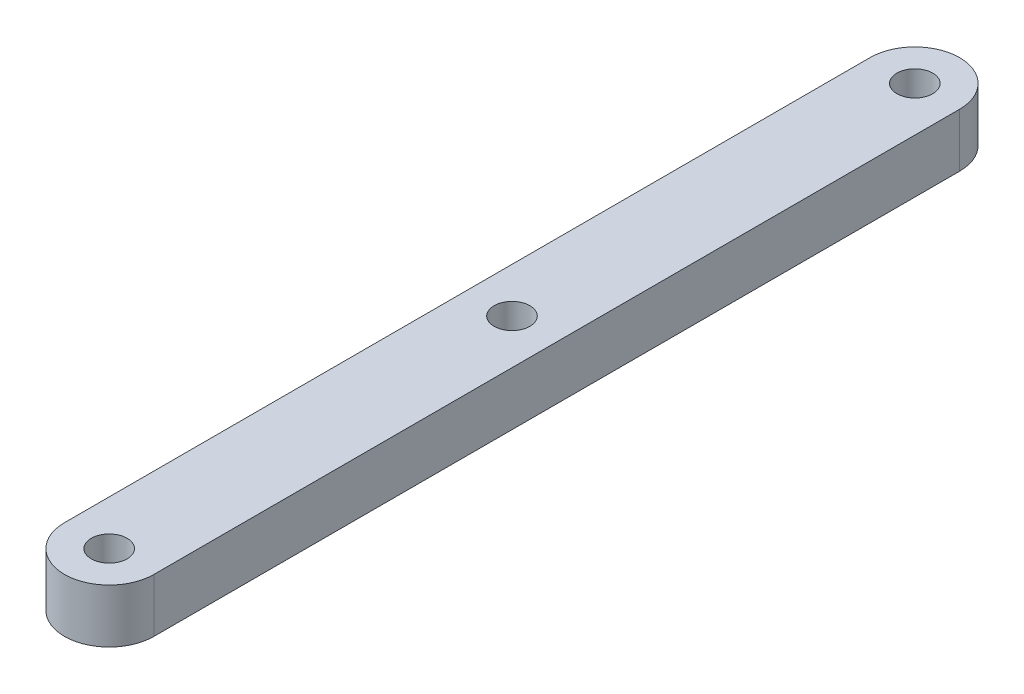
ISO-10303-21;
HEADER;
FILE_DESCRIPTION(('STEP AP214'),'2;1');
FILE_NAME('part.step','',(''),(''),'','','');
FILE_SCHEMA(('AUTOMOTIVE_DESIGN { 1 0 10303 214 1 1 1 1 }'));
ENDSEC;
DATA;
#1=APPLICATION_CONTEXT('core data for automotive mechanical design processes');
#2=APPLICATION_PROTOCOL_DEFINITION('international standard','automotive_design',2000,#1);
#3=PRODUCT_CONTEXT('',#1,'mechanical');
#4=PRODUCT('Part','Part','',(#3));
#5=PRODUCT_RELATED_PRODUCT_CATEGORY('part','',(#4));
#6=PRODUCT_DEFINITION_FORMATION('','',#4);
#7=PRODUCT_DEFINITION_CONTEXT('part definition',#1,'design');
#8=PRODUCT_DEFINITION('design','',#6,#7);
#9=PRODUCT_DEFINITION_SHAPE('','',#8);
#10=(LENGTH_UNIT() NAMED_UNIT(*) SI_UNIT(.MILLI.,.METRE.));
#11=(NAMED_UNIT(*) PLANE_ANGLE_UNIT() SI_UNIT($,.RADIAN.));
#12=(NAMED_UNIT(*) SI_UNIT($,.STERADIAN.) SOLID_ANGLE_UNIT());
#13=UNCERTAINTY_MEASURE_WITH_UNIT(LENGTH_MEASURE(1.E-05),#10,'distance_accuracy_value','');
#14=(GEOMETRIC_REPRESENTATION_CONTEXT(3) GLOBAL_UNCERTAINTY_ASSIGNED_CONTEXT((#13)) GLOBAL_UNIT_ASSIGNED_CONTEXT((#10,
#11,#12)) REPRESENTATION_CONTEXT('',''));
#15=CARTESIAN_POINT('',(0.,0.,0.));
#16=DIRECTION('',(0.,0.,1.));
#17=DIRECTION('',(1.,0.,0.));
#18=AXIS2_PLACEMENT_3D('',#15,#16,#17);
#19=CARTESIAN_POINT('',(0.,3.,-22.5));
#20=DIRECTION('',(0.,1.,0.));
#21=DIRECTION('',(0.,0.,1.));
#22=AXIS2_PLACEMENT_3D('',#19,#20,#21);
#23=PLANE('',#22);
#24=CARTESIAN_POINT('',(0.,3.,-22.5));
#25=DIRECTION('',(0.,1.,0.));
#26=DIRECTION('',(0.,0.,1.));
#27=AXIS2_PLACEMENT_3D('',#24,#25,#26);
#28=CIRCLE('',#27,1.);
#29=CARTESIAN_POINT('',(0.,3.,-21.5));
#30=VERTEX_POINT('',#29);
#31=EDGE_CURVE('E115',#30,#30,#28,.T.);
#32=ORIENTED_EDGE('',*,*,#31,.F.);
#33=EDGE_LOOP('',(#32));
#34=FACE_BOUND('',#33,.T.);
#35=CARTESIAN_POINT('',(0.,3.,-22.5));
#36=DIRECTION('',(0.,1.,0.));
#37=DIRECTION('',(0.,0.,1.));
#38=AXIS2_PLACEMENT_3D('',#35,#36,#37);
#39=CIRCLE('',#38,2.5);
#40=CARTESIAN_POINT('',(2.49999999999999,3.,-22.5));
#41=VERTEX_POINT('',#40);
#42=CARTESIAN_POINT('',(-2.50000000000001,3.,-22.5));
#43=VERTEX_POINT('',#42);
#44=EDGE_CURVE('E85',#41,#43,#39,.T.);
#45=ORIENTED_EDGE('',*,*,#44,.T.);
#46=DIRECTION('',(0.,0.,1.));
#47=VECTOR('',#46,1.);
#48=CARTESIAN_POINT('',(-2.50000000000001,3.,-22.5));
#49=LINE('',#48,#47);
#50=CARTESIAN_POINT('',(-2.49999999999999,3.,22.5));
#51=VERTEX_POINT('',#50);
#52=EDGE_CURVE('E80',#43,#51,#49,.T.);
#53=ORIENTED_EDGE('',*,*,#52,.T.);
#54=CARTESIAN_POINT('',(0.,3.,22.5));
#55=DIRECTION('',(0.,1.,0.));
#56=DIRECTION('',(0.,0.,1.));
#57=AXIS2_PLACEMENT_3D('',#54,#55,#56);
#58=CIRCLE('',#57,2.5);
#59=CARTESIAN_POINT('',(2.5,3.,22.5));
#60=VERTEX_POINT('',#59);
#61=EDGE_CURVE('E83',#51,#60,#58,.T.);
#62=ORIENTED_EDGE('',*,*,#61,.T.);
#63=DIRECTION('',(0.,0.,-1.));
#64=VECTOR('',#63,1.);
#65=CARTESIAN_POINT('',(2.49999999999999,3.,-22.5));
#66=LINE('',#65,#64);
#67=EDGE_CURVE('E50',#60,#41,#66,.T.);
#68=ORIENTED_EDGE('',*,*,#67,.T.);
#69=EDGE_LOOP('',(#45,#53,#62,#68));
#70=FACE_BOUND('',#69,.T.);
#71=CARTESIAN_POINT('',(0.,3.,22.5));
#72=DIRECTION('',(0.,1.,0.));
#73=DIRECTION('',(0.,0.,1.));
#74=AXIS2_PLACEMENT_3D('',#71,#72,#73);
#75=CIRCLE('',#74,1.);
#76=CARTESIAN_POINT('',(0.,3.,23.5));
#77=VERTEX_POINT('',#76);
#78=EDGE_CURVE('E100',#77,#77,#75,.T.);
#79=ORIENTED_EDGE('',*,*,#78,.F.);
#80=EDGE_LOOP('',(#79));
#81=FACE_BOUND('',#80,.T.);
#82=CARTESIAN_POINT('',(0.,3.,0.));
#83=DIRECTION('',(0.,1.,0.));
#84=DIRECTION('',(0.,0.,1.));
#85=AXIS2_PLACEMENT_3D('',#82,#83,#84);
#86=CIRCLE('',#85,1.);
#87=CARTESIAN_POINT('',(0.,3.,1.));
#88=VERTEX_POINT('',#87);
#89=EDGE_CURVE('E121',#88,#88,#86,.T.);
#90=ORIENTED_EDGE('',*,*,#89,.F.);
#91=EDGE_LOOP('',(#90));
#92=FACE_BOUND('',#91,.T.);
#93=ADVANCED_FACE('F33',(#34,#70,#81,#92),#23,.T.);
#94=CARTESIAN_POINT('',(0.,0.,-22.5));
#95=DIRECTION('',(0.,1.,0.));
#96=DIRECTION('',(0.,0.,1.));
#97=AXIS2_PLACEMENT_3D('',#94,#95,#96);
#98=PLANE('',#97);
#99=CARTESIAN_POINT('',(0.,0.,-22.5));
#100=DIRECTION('',(0.,1.,0.));
#101=DIRECTION('',(0.,0.,1.));
#102=AXIS2_PLACEMENT_3D('',#99,#100,#101);
#103=CIRCLE('',#102,2.5);
#104=CARTESIAN_POINT('',(2.49999999999999,0.,-22.5));
#105=VERTEX_POINT('',#104);
#106=CARTESIAN_POINT('',(-2.50000000000001,0.,-22.5));
#107=VERTEX_POINT('',#106);
#108=EDGE_CURVE('E97',#105,#107,#103,.T.);
#109=ORIENTED_EDGE('',*,*,#108,.F.);
#110=DIRECTION('',(0.,0.,-1.));
#111=VECTOR('',#110,1.);
#112=CARTESIAN_POINT('',(2.49999999999999,0.,-22.5));
#113=LINE('',#112,#111);
#114=CARTESIAN_POINT('',(2.5,0.,22.5));
#115=VERTEX_POINT('',#114);
#116=EDGE_CURVE('E73',#115,#105,#113,.T.);
#117=ORIENTED_EDGE('',*,*,#116,.F.);
#118=CARTESIAN_POINT('',(0.,0.,22.5));
#119=DIRECTION('',(0.,1.,0.));
#120=DIRECTION('',(0.,0.,1.));
#121=AXIS2_PLACEMENT_3D('',#118,#119,#120);
#122=CIRCLE('',#121,2.5);
#123=CARTESIAN_POINT('',(-2.49999999999999,0.,22.5));
#124=VERTEX_POINT('',#123);
#125=EDGE_CURVE('E67',#124,#115,#122,.T.);
#126=ORIENTED_EDGE('',*,*,#125,.F.);
#127=DIRECTION('',(0.,0.,1.));
#128=VECTOR('',#127,1.);
#129=CARTESIAN_POINT('',(-2.50000000000001,0.,-22.5));
#130=LINE('',#129,#128);
#131=EDGE_CURVE('E89',#107,#124,#130,.T.);
#132=ORIENTED_EDGE('',*,*,#131,.F.);
#133=EDGE_LOOP('',(#109,#117,#126,#132));
#134=FACE_BOUND('',#133,.T.);
#135=CARTESIAN_POINT('',(0.,0.,22.5));
#136=DIRECTION('',(0.,1.,0.));
#137=DIRECTION('',(0.,0.,1.));
#138=AXIS2_PLACEMENT_3D('',#135,#136,#137);
#139=CIRCLE('',#138,1.);
#140=CARTESIAN_POINT('',(0.,0.,23.5));
#141=VERTEX_POINT('',#140);
#142=EDGE_CURVE('E112',#141,#141,#139,.T.);
#143=ORIENTED_EDGE('',*,*,#142,.T.);
#144=EDGE_LOOP('',(#143));
#145=FACE_BOUND('',#144,.T.);
#146=CARTESIAN_POINT('',(0.,0.,-22.5));
#147=DIRECTION('',(0.,1.,0.));
#148=DIRECTION('',(0.,0.,1.));
#149=AXIS2_PLACEMENT_3D('',#146,#147,#148);
#150=CIRCLE('',#149,1.);
#151=CARTESIAN_POINT('',(0.,0.,-21.5));
#152=VERTEX_POINT('',#151);
#153=EDGE_CURVE('E118',#152,#152,#150,.T.);
#154=ORIENTED_EDGE('',*,*,#153,.T.);
#155=EDGE_LOOP('',(#154));
#156=FACE_BOUND('',#155,.T.);
#157=CARTESIAN_POINT('',(0.,0.,0.));
#158=DIRECTION('',(0.,1.,0.));
#159=DIRECTION('',(0.,0.,1.));
#160=AXIS2_PLACEMENT_3D('',#157,#158,#159);
#161=CIRCLE('',#160,1.);
#162=CARTESIAN_POINT('',(0.,0.,1.));
#163=VERTEX_POINT('',#162);
#164=EDGE_CURVE('E124',#163,#163,#161,.T.);
#165=ORIENTED_EDGE('',*,*,#164,.T.);
#166=EDGE_LOOP('',(#165));
#167=FACE_BOUND('',#166,.T.);
#168=ADVANCED_FACE('F108',(#134,#145,#156,#167),#98,.F.);
#169=CARTESIAN_POINT('',(0.,3.,-22.5));
#170=DIRECTION('',(0.,-1.,0.));
#171=DIRECTION('',(0.,0.,-1.));
#172=AXIS2_PLACEMENT_3D('',#169,#170,#171);
#173=CYLINDRICAL_SURFACE('',#172,2.5);
#174=ORIENTED_EDGE('',*,*,#108,.T.);
#175=DIRECTION('',(0.,-1.,0.));
#176=VECTOR('',#175,1.);
#177=CARTESIAN_POINT('',(-2.50000000000001,3.,-22.5));
#178=LINE('',#177,#176);
#179=EDGE_CURVE('E11',#43,#107,#178,.T.);
#180=ORIENTED_EDGE('',*,*,#179,.F.);
#181=ORIENTED_EDGE('',*,*,#44,.F.);
#182=DIRECTION('',(0.,-1.,0.));
#183=VECTOR('',#182,1.);
#184=CARTESIAN_POINT('',(2.49999999999999,3.,-22.5));
#185=LINE('',#184,#183);
#186=EDGE_CURVE('E93',#41,#105,#185,.T.);
#187=ORIENTED_EDGE('',*,*,#186,.T.);
#188=EDGE_LOOP('',(#174,#180,#181,#187));
#189=FACE_BOUND('',#188,.T.);
#190=ADVANCED_FACE('F35',(#189),#173,.T.);
#191=CARTESIAN_POINT('',(-2.50000000000001,3.,-22.5));
#192=DIRECTION('',(1.,0.,0.));
#193=DIRECTION('',(0.,0.,-1.));
#194=AXIS2_PLACEMENT_3D('',#191,#192,#193);
#195=PLANE('',#194);
#196=ORIENTED_EDGE('',*,*,#131,.T.);
#197=DIRECTION('',(0.,-1.,0.));
#198=VECTOR('',#197,1.);
#199=CARTESIAN_POINT('',(-2.49999999999999,3.,22.5));
#200=LINE('',#199,#198);
#201=EDGE_CURVE('E42',#51,#124,#200,.T.);
#202=ORIENTED_EDGE('',*,*,#201,.F.);
#203=ORIENTED_EDGE('',*,*,#52,.F.);
#204=ORIENTED_EDGE('',*,*,#179,.T.);
#205=EDGE_LOOP('',(#196,#202,#203,#204));
#206=FACE_BOUND('',#205,.T.);
#207=ADVANCED_FACE('F88',(#206),#195,.F.);
#208=CARTESIAN_POINT('',(0.,3.,22.5));
#209=DIRECTION('',(0.,-1.,0.));
#210=DIRECTION('',(0.,0.,-1.));
#211=AXIS2_PLACEMENT_3D('',#208,#209,#210);
#212=CYLINDRICAL_SURFACE('',#211,2.5);
#213=ORIENTED_EDGE('',*,*,#125,.T.);
#214=DIRECTION('',(0.,-1.,0.));
#215=VECTOR('',#214,1.);
#216=CARTESIAN_POINT('',(2.5,3.,22.5));
#217=LINE('',#216,#215);
#218=EDGE_CURVE('E90',#60,#115,#217,.T.);
#219=ORIENTED_EDGE('',*,*,#218,.F.);
#220=ORIENTED_EDGE('',*,*,#61,.F.);
#221=ORIENTED_EDGE('',*,*,#201,.T.);
#222=EDGE_LOOP('',(#213,#219,#220,#221));
#223=FACE_BOUND('',#222,.T.);
#224=ADVANCED_FACE('F91',(#223),#212,.T.);
#225=CARTESIAN_POINT('',(2.49999999999999,3.,-22.5));
#226=DIRECTION('',(-1.,0.,0.));
#227=DIRECTION('',(0.,0.,1.));
#228=AXIS2_PLACEMENT_3D('',#225,#226,#227);
#229=PLANE('',#228);
#230=ORIENTED_EDGE('',*,*,#116,.T.);
#231=ORIENTED_EDGE('',*,*,#186,.F.);
#232=ORIENTED_EDGE('',*,*,#67,.F.);
#233=ORIENTED_EDGE('',*,*,#218,.T.);
#234=EDGE_LOOP('',(#230,#231,#232,#233));
#235=FACE_BOUND('',#234,.T.);
#236=ADVANCED_FACE('F105',(#235),#229,.F.);
#237=CARTESIAN_POINT('',(0.,3.,22.5));
#238=DIRECTION('',(0.,-1.,0.));
#239=DIRECTION('',(0.,0.,-1.));
#240=AXIS2_PLACEMENT_3D('',#237,#238,#239);
#241=CYLINDRICAL_SURFACE('',#240,1.);
#242=ORIENTED_EDGE('',*,*,#78,.T.);
#243=EDGE_LOOP('',(#242));
#244=FACE_BOUND('',#243,.T.);
#245=ORIENTED_EDGE('',*,*,#142,.F.);
#246=EDGE_LOOP('',(#245));
#247=FACE_BOUND('',#246,.T.);
#248=ADVANCED_FACE('F142',(#244,#247),#241,.F.);
#249=CARTESIAN_POINT('',(0.,3.,-22.5));
#250=DIRECTION('',(0.,-1.,0.));
#251=DIRECTION('',(0.,0.,-1.));
#252=AXIS2_PLACEMENT_3D('',#249,#250,#251);
#253=CYLINDRICAL_SURFACE('',#252,1.);
#254=ORIENTED_EDGE('',*,*,#31,.T.);
#255=EDGE_LOOP('',(#254));
#256=FACE_BOUND('',#255,.T.);
#257=ORIENTED_EDGE('',*,*,#153,.F.);
#258=EDGE_LOOP('',(#257));
#259=FACE_BOUND('',#258,.T.);
#260=ADVANCED_FACE('F188',(#256,#259),#253,.F.);
#261=CARTESIAN_POINT('',(0.,3.,0.));
#262=DIRECTION('',(0.,-1.,0.));
#263=DIRECTION('',(0.,0.,-1.));
#264=AXIS2_PLACEMENT_3D('',#261,#262,#263);
#265=CYLINDRICAL_SURFACE('',#264,1.);
#266=ORIENTED_EDGE('',*,*,#89,.T.);
#267=EDGE_LOOP('',(#266));
#268=FACE_BOUND('',#267,.T.);
#269=ORIENTED_EDGE('',*,*,#164,.F.);
#270=EDGE_LOOP('',(#269));
#271=FACE_BOUND('',#270,.T.);
#272=ADVANCED_FACE('F130',(#268,#271),#265,.F.);
#273=CLOSED_SHELL('',(#93,#168,#190,#207,#224,#236,#248,#260,#272));
#274=MANIFOLD_SOLID_BREP('B2',#273);
#275=ADVANCED_BREP_SHAPE_REPRESENTATION('',(#18,#274),#14);
#276=SHAPE_DEFINITION_REPRESENTATION(#9,#275);
ENDSEC;
END-ISO-10303-21;
